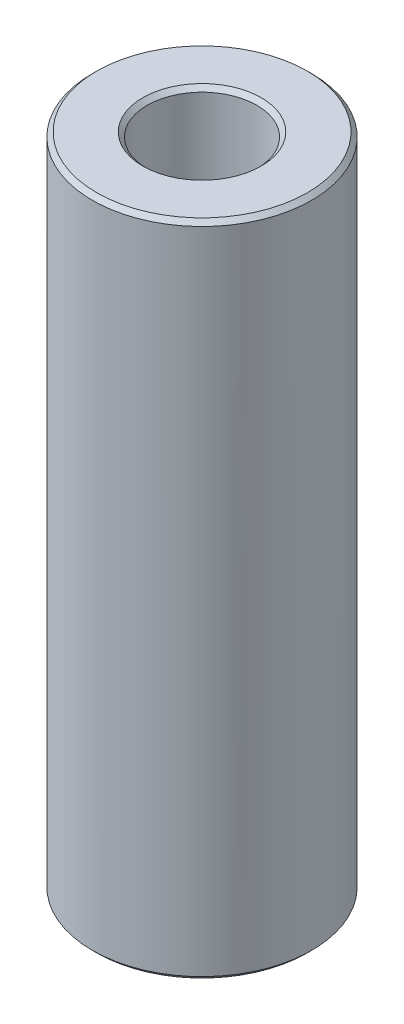
ISO-10303-21;
HEADER;
FILE_DESCRIPTION(('STEP AP214'),'2;1');
FILE_NAME('part.step','',(''),(''),'','','');
FILE_SCHEMA(('AUTOMOTIVE_DESIGN { 1 0 10303 214 1 1 1 1 }'));
ENDSEC;
DATA;
#1=APPLICATION_CONTEXT('core data for automotive mechanical design processes');
#2=APPLICATION_PROTOCOL_DEFINITION('international standard','automotive_design',2000,#1);
#3=PRODUCT_CONTEXT('',#1,'mechanical');
#4=PRODUCT('Part','Part','',(#3));
#5=PRODUCT_RELATED_PRODUCT_CATEGORY('part','',(#4));
#6=PRODUCT_DEFINITION_FORMATION('','',#4);
#7=PRODUCT_DEFINITION_CONTEXT('part definition',#1,'design');
#8=PRODUCT_DEFINITION('design','',#6,#7);
#9=PRODUCT_DEFINITION_SHAPE('','',#8);
#10=(LENGTH_UNIT() NAMED_UNIT(*) SI_UNIT(.MILLI.,.METRE.));
#11=(NAMED_UNIT(*) PLANE_ANGLE_UNIT() SI_UNIT($,.RADIAN.));
#12=(NAMED_UNIT(*) SI_UNIT($,.STERADIAN.) SOLID_ANGLE_UNIT());
#13=UNCERTAINTY_MEASURE_WITH_UNIT(LENGTH_MEASURE(1.E-05),#10,'distance_accuracy_value','');
#14=(GEOMETRIC_REPRESENTATION_CONTEXT(3) GLOBAL_UNCERTAINTY_ASSIGNED_CONTEXT((#13)) GLOBAL_UNIT_ASSIGNED_CONTEXT((#10,
#11,#12)) REPRESENTATION_CONTEXT('',''));
#15=CARTESIAN_POINT('',(0.,0.,0.));
#16=DIRECTION('',(0.,0.,1.));
#17=DIRECTION('',(1.,0.,0.));
#18=AXIS2_PLACEMENT_3D('',#15,#16,#17);
#19=CARTESIAN_POINT('',(0.,38.1,0.));
#20=DIRECTION('',(0.,-1.,0.));
#21=DIRECTION('',(0.,0.,-1.));
#22=AXIS2_PLACEMENT_3D('',#19,#20,#21);
#23=CYLINDRICAL_SURFACE('',#22,3.175);
#24=CARTESIAN_POINT('',(0.,0.253999999983989,0.));
#25=DIRECTION('',(0.,-1.,0.));
#26=DIRECTION('',(0.,0.,-1.));
#27=AXIS2_PLACEMENT_3D('',#24,#25,#26);
#28=CIRCLE('',#27,3.17499999999882);
#29=CARTESIAN_POINT('',(0.,0.253999999983989,-3.17499999999882));
#30=VERTEX_POINT('',#29);
#31=EDGE_CURVE('E30',#30,#30,#28,.T.);
#32=ORIENTED_EDGE('',*,*,#31,.T.);
#33=EDGE_LOOP('',(#32));
#34=FACE_BOUND('',#33,.T.);
#35=CARTESIAN_POINT('',(0.,37.8460000000018,0.));
#36=DIRECTION('',(0.,1.,0.));
#37=DIRECTION('',(0.,0.,1.));
#38=AXIS2_PLACEMENT_3D('',#35,#36,#37);
#39=CIRCLE('',#38,3.17500000005566);
#40=CARTESIAN_POINT('',(0.,37.8460000000018,3.17500000005566));
#41=VERTEX_POINT('',#40);
#42=EDGE_CURVE('E33',#41,#41,#39,.T.);
#43=ORIENTED_EDGE('',*,*,#42,.T.);
#44=EDGE_LOOP('',(#43));
#45=FACE_BOUND('',#44,.T.);
#46=ADVANCED_FACE('F15',(#34,#45),#23,.F.);
#47=CARTESIAN_POINT('',(0.,38.099999999929,0.));
#48=DIRECTION('',(0.,1.,0.));
#49=DIRECTION('',(0.,0.,1.));
#50=AXIS2_PLACEMENT_3D('',#47,#48,#49);
#51=CONICAL_SURFACE('',#50,3.42899999998281,0.785398163509345);
#52=ORIENTED_EDGE('',*,*,#42,.F.);
#53=EDGE_LOOP('',(#52));
#54=FACE_BOUND('',#53,.T.);
#55=CARTESIAN_POINT('',(0.,38.0999999999858,0.));
#56=DIRECTION('',(0.,1.,0.));
#57=DIRECTION('',(0.,0.,1.));
#58=AXIS2_PLACEMENT_3D('',#55,#56,#57);
#59=CIRCLE('',#58,3.42900000003965);
#60=CARTESIAN_POINT('',(0.,38.0999999999858,3.42900000003965));
#61=VERTEX_POINT('',#60);
#62=EDGE_CURVE('E18',#61,#61,#59,.F.);
#63=ORIENTED_EDGE('',*,*,#62,.F.);
#64=EDGE_LOOP('',(#63));
#65=FACE_BOUND('',#64,.T.);
#66=ADVANCED_FACE('F49',(#54,#65),#51,.F.);
#67=CARTESIAN_POINT('',(0.,0.,0.));
#68=DIRECTION('',(0.,-1.,0.));
#69=DIRECTION('',(0.,0.,-1.));
#70=AXIS2_PLACEMENT_3D('',#67,#68,#69);
#71=CONICAL_SURFACE('',#70,3.42899999998281,0.785398163397448);
#72=CARTESIAN_POINT('',(0.,0.,0.));
#73=DIRECTION('',(0.,-1.,0.));
#74=DIRECTION('',(0.,0.,-1.));
#75=AXIS2_PLACEMENT_3D('',#72,#73,#74);
#76=CIRCLE('',#75,3.42899999998281);
#77=CARTESIAN_POINT('',(0.,0.,-3.42899999998281));
#78=VERTEX_POINT('',#77);
#79=EDGE_CURVE('E40',#78,#78,#76,.T.);
#80=ORIENTED_EDGE('',*,*,#79,.T.);
#81=EDGE_LOOP('',(#80));
#82=FACE_BOUND('',#81,.T.);
#83=ORIENTED_EDGE('',*,*,#31,.F.);
#84=EDGE_LOOP('',(#83));
#85=FACE_BOUND('',#84,.T.);
#86=ADVANCED_FACE('F51',(#82,#85),#71,.F.);
#87=CARTESIAN_POINT('',(0.,38.1,0.));
#88=DIRECTION('',(0.,1.,0.));
#89=DIRECTION('',(0.,0.,1.));
#90=AXIS2_PLACEMENT_3D('',#87,#88,#89);
#91=PLANE('',#90);
#92=CARTESIAN_POINT('',(0.,38.099999999929,0.));
#93=DIRECTION('',(0.,-1.,0.));
#94=DIRECTION('',(0.,0.,-1.));
#95=AXIS2_PLACEMENT_3D('',#92,#93,#94);
#96=CIRCLE('',#95,6.09600000007049);
#97=CARTESIAN_POINT('',(0.,38.099999999929,-6.09600000007049));
#98=VERTEX_POINT('',#97);
#99=EDGE_CURVE('E38',#98,#98,#96,.T.);
#100=ORIENTED_EDGE('',*,*,#99,.F.);
#101=EDGE_LOOP('',(#100));
#102=FACE_BOUND('',#101,.T.);
#103=ORIENTED_EDGE('',*,*,#62,.T.);
#104=EDGE_LOOP('',(#103));
#105=FACE_BOUND('',#104,.T.);
#106=ADVANCED_FACE('F47',(#102,#105),#91,.T.);
#107=CARTESIAN_POINT('',(0.,0.,0.));
#108=DIRECTION('',(0.,1.,0.));
#109=DIRECTION('',(0.,0.,1.));
#110=AXIS2_PLACEMENT_3D('',#107,#108,#109);
#111=PLANE('',#110);
#112=CARTESIAN_POINT('',(0.,-5.6843418860808E-11,0.));
#113=DIRECTION('',(0.,1.,0.));
#114=DIRECTION('',(0.,0.,1.));
#115=AXIS2_PLACEMENT_3D('',#112,#113,#114);
#116=CIRCLE('',#115,6.09600000001365);
#117=CARTESIAN_POINT('',(0.,-5.6843418860808E-11,6.09600000001365));
#118=VERTEX_POINT('',#117);
#119=EDGE_CURVE('E27',#118,#118,#116,.T.);
#120=ORIENTED_EDGE('',*,*,#119,.F.);
#121=EDGE_LOOP('',(#120));
#122=FACE_BOUND('',#121,.T.);
#123=ORIENTED_EDGE('',*,*,#79,.F.);
#124=EDGE_LOOP('',(#123));
#125=FACE_BOUND('',#124,.T.);
#126=ADVANCED_FACE('F75',(#122,#125),#111,.F.);
#127=CARTESIAN_POINT('',(0.,37.8460000000587,0.));
#128=DIRECTION('',(0.,-1.,0.));
#129=DIRECTION('',(0.,0.,-1.));
#130=AXIS2_PLACEMENT_3D('',#127,#128,#129);
#131=CONICAL_SURFACE('',#130,6.34999999994079,0.785398163397448);
#132=CARTESIAN_POINT('',(0.,37.846,0.));
#133=DIRECTION('',(0.,-1.,0.));
#134=DIRECTION('',(0.,0.,-1.));
#135=AXIS2_PLACEMENT_3D('',#132,#133,#134);
#136=CIRCLE('',#135,6.35);
#137=CARTESIAN_POINT('',(0.,37.846,-6.35));
#138=VERTEX_POINT('',#137);
#139=EDGE_CURVE('E22',#138,#138,#136,.T.);
#140=ORIENTED_EDGE('',*,*,#139,.F.);
#141=EDGE_LOOP('',(#140));
#142=FACE_BOUND('',#141,.T.);
#143=ORIENTED_EDGE('',*,*,#99,.T.);
#144=EDGE_LOOP('',(#143));
#145=FACE_BOUND('',#144,.T.);
#146=ADVANCED_FACE('F68',(#142,#145),#131,.T.);
#147=CARTESIAN_POINT('',(0.,0.253999999927146,0.));
#148=DIRECTION('',(0.,1.,0.));
#149=DIRECTION('',(0.,0.,1.));
#150=AXIS2_PLACEMENT_3D('',#147,#148,#149);
#151=CONICAL_SURFACE('',#150,6.34999999999764,0.785398163397448);
#152=CARTESIAN_POINT('',(0.,0.254000000000025,0.));
#153=DIRECTION('',(0.,-1.,0.));
#154=DIRECTION('',(0.,0.,-1.));
#155=AXIS2_PLACEMENT_3D('',#152,#153,#154);
#156=CIRCLE('',#155,6.35);
#157=CARTESIAN_POINT('',(0.,0.254000000000025,-6.35));
#158=VERTEX_POINT('',#157);
#159=EDGE_CURVE('E10',#158,#158,#156,.F.);
#160=ORIENTED_EDGE('',*,*,#159,.F.);
#161=EDGE_LOOP('',(#160));
#162=FACE_BOUND('',#161,.T.);
#163=ORIENTED_EDGE('',*,*,#119,.T.);
#164=EDGE_LOOP('',(#163));
#165=FACE_BOUND('',#164,.T.);
#166=ADVANCED_FACE('F63',(#162,#165),#151,.T.);
#167=CARTESIAN_POINT('',(0.,38.1,0.));
#168=DIRECTION('',(0.,-1.,0.));
#169=DIRECTION('',(0.,0.,-1.));
#170=AXIS2_PLACEMENT_3D('',#167,#168,#169);
#171=CYLINDRICAL_SURFACE('',#170,6.35);
#172=ORIENTED_EDGE('',*,*,#159,.T.);
#173=EDGE_LOOP('',(#172));
#174=FACE_BOUND('',#173,.T.);
#175=ORIENTED_EDGE('',*,*,#139,.T.);
#176=EDGE_LOOP('',(#175));
#177=FACE_BOUND('',#176,.T.);
#178=ADVANCED_FACE('F61',(#174,#177),#171,.T.);
#179=CLOSED_SHELL('',(#46,#66,#86,#106,#126,#146,#166,#178));
#180=MANIFOLD_SOLID_BREP('B1',#179);
#181=ADVANCED_BREP_SHAPE_REPRESENTATION('',(#18,#180),#14);
#182=SHAPE_DEFINITION_REPRESENTATION(#9,#181);
ENDSEC;
END-ISO-10303-21;
